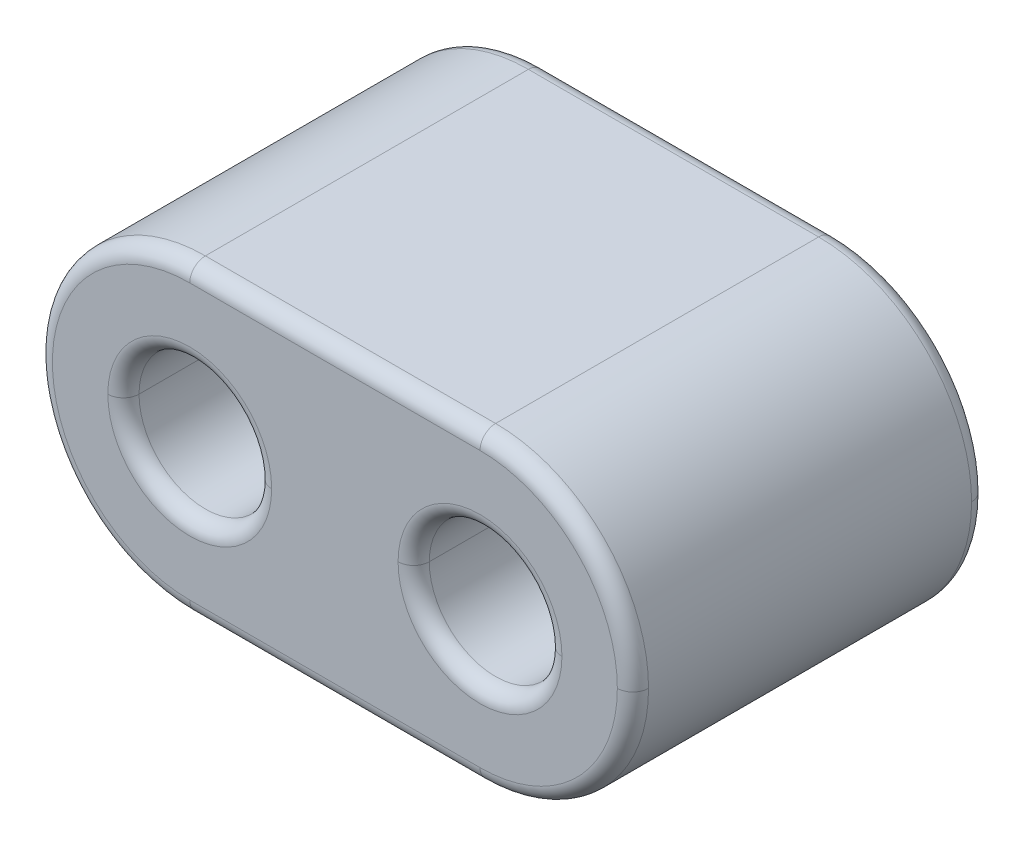
ISO-10303-21;
HEADER;
FILE_DESCRIPTION(('STEP AP214'),'2;1');
FILE_NAME('part.step','',(''),(''),'','','');
FILE_SCHEMA(('AUTOMOTIVE_DESIGN { 1 0 10303 214 1 1 1 1 }'));
ENDSEC;
DATA;
#1=APPLICATION_CONTEXT('core data for automotive mechanical design processes');
#2=APPLICATION_PROTOCOL_DEFINITION('international standard','automotive_design',2000,#1);
#3=PRODUCT_CONTEXT('',#1,'mechanical');
#4=PRODUCT('Part','Part','',(#3));
#5=PRODUCT_RELATED_PRODUCT_CATEGORY('part','',(#4));
#6=PRODUCT_DEFINITION_FORMATION('','',#4);
#7=PRODUCT_DEFINITION_CONTEXT('part definition',#1,'design');
#8=PRODUCT_DEFINITION('design','',#6,#7);
#9=PRODUCT_DEFINITION_SHAPE('','',#8);
#10=(LENGTH_UNIT() NAMED_UNIT(*) SI_UNIT(.MILLI.,.METRE.));
#11=(NAMED_UNIT(*) PLANE_ANGLE_UNIT() SI_UNIT($,.RADIAN.));
#12=(NAMED_UNIT(*) SI_UNIT($,.STERADIAN.) SOLID_ANGLE_UNIT());
#13=UNCERTAINTY_MEASURE_WITH_UNIT(LENGTH_MEASURE(1.E-05),#10,'distance_accuracy_value','');
#14=(GEOMETRIC_REPRESENTATION_CONTEXT(3) GLOBAL_UNCERTAINTY_ASSIGNED_CONTEXT((#13)) GLOBAL_UNIT_ASSIGNED_CONTEXT((#10,
#11,#12)) REPRESENTATION_CONTEXT('',''));
#15=CARTESIAN_POINT('',(0.,0.,0.));
#16=DIRECTION('',(0.,0.,1.));
#17=DIRECTION('',(1.,0.,0.));
#18=AXIS2_PLACEMENT_3D('',#15,#16,#17);
#19=CARTESIAN_POINT('',(-0.93,0.98,1.035));
#20=DIRECTION('',(0.,0.,1.));
#21=DIRECTION('',(1.,0.,0.));
#22=AXIS2_PLACEMENT_3D('',#19,#20,#21);
#23=TOROIDAL_SURFACE('',#22,0.525,0.1);
#24=CARTESIAN_POINT('',(-0.93,0.98,1.135));
#25=DIRECTION('',(0.,0.,-1.));
#26=DIRECTION('',(1.,0.,0.));
#27=AXIS2_PLACEMENT_3D('',#24,#25,#26);
#28=CIRCLE('',#27,0.525);
#29=CARTESIAN_POINT('',(-1.455,0.98,1.135));
#30=VERTEX_POINT('',#29);
#31=CARTESIAN_POINT('',(-0.405,0.98,1.135));
#32=VERTEX_POINT('',#31);
#33=EDGE_CURVE('E11',#30,#32,#28,.T.);
#34=ORIENTED_EDGE('',*,*,#33,.F.);
#35=CARTESIAN_POINT('',(-1.455,0.98,1.035));
#36=DIRECTION('',(0.,1.,0.));
#37=DIRECTION('',(-1.,0.,0.));
#38=AXIS2_PLACEMENT_3D('',#35,#36,#37);
#39=CIRCLE('',#38,0.1);
#40=CARTESIAN_POINT('',(-1.355,0.98,1.035));
#41=VERTEX_POINT('',#40);
#42=EDGE_CURVE('E24',#30,#41,#39,.T.);
#43=ORIENTED_EDGE('',*,*,#42,.T.);
#44=CARTESIAN_POINT('',(-0.93,0.98,1.035));
#45=DIRECTION('',(0.,0.,1.));
#46=DIRECTION('',(1.,0.,0.));
#47=AXIS2_PLACEMENT_3D('',#44,#45,#46);
#48=CIRCLE('',#47,0.425);
#49=CARTESIAN_POINT('',(-0.505,0.98,1.035));
#50=VERTEX_POINT('',#49);
#51=EDGE_CURVE('E314',#50,#41,#48,.T.);
#52=ORIENTED_EDGE('',*,*,#51,.F.);
#53=CARTESIAN_POINT('',(-0.405,0.98,1.035));
#54=DIRECTION('',(0.,-1.,0.));
#55=DIRECTION('',(0.,0.,-1.));
#56=AXIS2_PLACEMENT_3D('',#53,#54,#55);
#57=CIRCLE('',#56,0.1);
#58=EDGE_CURVE('E311',#32,#50,#57,.T.);
#59=ORIENTED_EDGE('',*,*,#58,.F.);
#60=EDGE_LOOP('',(#34,#43,#52,#59));
#61=FACE_BOUND('',#60,.T.);
#62=ADVANCED_FACE('F17',(#61),#23,.T.);
#63=CARTESIAN_POINT('',(-0.93,0.98,-1.035));
#64=DIRECTION('',(0.,0.,1.));
#65=DIRECTION('',(1.,0.,0.));
#66=AXIS2_PLACEMENT_3D('',#63,#64,#65);
#67=TOROIDAL_SURFACE('',#66,0.525,0.1);
#68=CARTESIAN_POINT('',(-0.93,0.98,-1.035));
#69=DIRECTION('',(0.,0.,-1.));
#70=DIRECTION('',(1.,0.,0.));
#71=AXIS2_PLACEMENT_3D('',#68,#69,#70);
#72=CIRCLE('',#71,0.425);
#73=CARTESIAN_POINT('',(-1.355,0.98,-1.035));
#74=VERTEX_POINT('',#73);
#75=CARTESIAN_POINT('',(-0.505,0.98,-1.035));
#76=VERTEX_POINT('',#75);
#77=EDGE_CURVE('E309',#74,#76,#72,.T.);
#78=ORIENTED_EDGE('',*,*,#77,.F.);
#79=CARTESIAN_POINT('',(-1.455,0.98,-1.035));
#80=DIRECTION('',(0.,1.,0.));
#81=DIRECTION('',(-1.,0.,0.));
#82=AXIS2_PLACEMENT_3D('',#79,#80,#81);
#83=CIRCLE('',#82,0.1);
#84=CARTESIAN_POINT('',(-1.455,0.98,-1.135));
#85=VERTEX_POINT('',#84);
#86=EDGE_CURVE('E307',#74,#85,#83,.T.);
#87=ORIENTED_EDGE('',*,*,#86,.T.);
#88=CARTESIAN_POINT('',(-0.93,0.98,-1.135));
#89=DIRECTION('',(0.,0.,1.));
#90=DIRECTION('',(1.,0.,0.));
#91=AXIS2_PLACEMENT_3D('',#88,#89,#90);
#92=CIRCLE('',#91,0.525);
#93=CARTESIAN_POINT('',(-0.405,0.98,-1.135));
#94=VERTEX_POINT('',#93);
#95=EDGE_CURVE('E304',#94,#85,#92,.T.);
#96=ORIENTED_EDGE('',*,*,#95,.F.);
#97=CARTESIAN_POINT('',(-0.405,0.98,-1.035));
#98=DIRECTION('',(0.,-1.,0.));
#99=DIRECTION('',(0.,0.,-1.));
#100=AXIS2_PLACEMENT_3D('',#97,#98,#99);
#101=CIRCLE('',#100,0.1);
#102=EDGE_CURVE('E301',#76,#94,#101,.T.);
#103=ORIENTED_EDGE('',*,*,#102,.F.);
#104=EDGE_LOOP('',(#78,#87,#96,#103));
#105=FACE_BOUND('',#104,.T.);
#106=ADVANCED_FACE('F345',(#105),#67,.T.);
#107=CARTESIAN_POINT('',(0.93,0.98,1.035));
#108=DIRECTION('',(0.,0.,1.));
#109=DIRECTION('',(1.,0.,0.));
#110=AXIS2_PLACEMENT_3D('',#107,#108,#109);
#111=TOROIDAL_SURFACE('',#110,0.525,0.1);
#112=CARTESIAN_POINT('',(0.93,0.98,1.135));
#113=DIRECTION('',(0.,0.,-1.));
#114=DIRECTION('',(1.,0.,0.));
#115=AXIS2_PLACEMENT_3D('',#112,#113,#114);
#116=CIRCLE('',#115,0.525);
#117=CARTESIAN_POINT('',(0.405,0.98,1.135));
#118=VERTEX_POINT('',#117);
#119=CARTESIAN_POINT('',(1.455,0.98,1.135));
#120=VERTEX_POINT('',#119);
#121=EDGE_CURVE('E299',#118,#120,#116,.T.);
#122=ORIENTED_EDGE('',*,*,#121,.F.);
#123=CARTESIAN_POINT('',(0.405,0.98,1.035));
#124=DIRECTION('',(0.,1.,0.));
#125=DIRECTION('',(-1.,0.,0.));
#126=AXIS2_PLACEMENT_3D('',#123,#124,#125);
#127=CIRCLE('',#126,0.1);
#128=CARTESIAN_POINT('',(0.505,0.98,1.035));
#129=VERTEX_POINT('',#128);
#130=EDGE_CURVE('E297',#118,#129,#127,.T.);
#131=ORIENTED_EDGE('',*,*,#130,.T.);
#132=CARTESIAN_POINT('',(0.93,0.98,1.035));
#133=DIRECTION('',(0.,0.,1.));
#134=DIRECTION('',(1.,0.,0.));
#135=AXIS2_PLACEMENT_3D('',#132,#133,#134);
#136=CIRCLE('',#135,0.425);
#137=CARTESIAN_POINT('',(1.355,0.98,1.035));
#138=VERTEX_POINT('',#137);
#139=EDGE_CURVE('E294',#138,#129,#136,.T.);
#140=ORIENTED_EDGE('',*,*,#139,.F.);
#141=CARTESIAN_POINT('',(1.455,0.98,1.035));
#142=DIRECTION('',(0.,-1.,0.));
#143=DIRECTION('',(0.,0.,-1.));
#144=AXIS2_PLACEMENT_3D('',#141,#142,#143);
#145=CIRCLE('',#144,0.1);
#146=EDGE_CURVE('E291',#120,#138,#145,.T.);
#147=ORIENTED_EDGE('',*,*,#146,.F.);
#148=EDGE_LOOP('',(#122,#131,#140,#147));
#149=FACE_BOUND('',#148,.T.);
#150=ADVANCED_FACE('F349',(#149),#111,.T.);
#151=CARTESIAN_POINT('',(0.93,0.98,-1.035));
#152=DIRECTION('',(0.,0.,1.));
#153=DIRECTION('',(1.,0.,0.));
#154=AXIS2_PLACEMENT_3D('',#151,#152,#153);
#155=TOROIDAL_SURFACE('',#154,0.525,0.1);
#156=CARTESIAN_POINT('',(0.93,0.98,-1.035));
#157=DIRECTION('',(0.,0.,-1.));
#158=DIRECTION('',(1.,0.,0.));
#159=AXIS2_PLACEMENT_3D('',#156,#157,#158);
#160=CIRCLE('',#159,0.425);
#161=CARTESIAN_POINT('',(0.505,0.98,-1.035));
#162=VERTEX_POINT('',#161);
#163=CARTESIAN_POINT('',(1.355,0.98,-1.035));
#164=VERTEX_POINT('',#163);
#165=EDGE_CURVE('E289',#162,#164,#160,.T.);
#166=ORIENTED_EDGE('',*,*,#165,.F.);
#167=CARTESIAN_POINT('',(0.405,0.98,-1.035));
#168=DIRECTION('',(0.,1.,0.));
#169=DIRECTION('',(-1.,0.,0.));
#170=AXIS2_PLACEMENT_3D('',#167,#168,#169);
#171=CIRCLE('',#170,0.1);
#172=CARTESIAN_POINT('',(0.405,0.98,-1.135));
#173=VERTEX_POINT('',#172);
#174=EDGE_CURVE('E287',#162,#173,#171,.T.);
#175=ORIENTED_EDGE('',*,*,#174,.T.);
#176=CARTESIAN_POINT('',(0.93,0.98,-1.135));
#177=DIRECTION('',(0.,0.,1.));
#178=DIRECTION('',(1.,0.,0.));
#179=AXIS2_PLACEMENT_3D('',#176,#177,#178);
#180=CIRCLE('',#179,0.525);
#181=CARTESIAN_POINT('',(1.455,0.98,-1.135));
#182=VERTEX_POINT('',#181);
#183=EDGE_CURVE('E284',#182,#173,#180,.T.);
#184=ORIENTED_EDGE('',*,*,#183,.F.);
#185=CARTESIAN_POINT('',(1.455,0.98,-1.035));
#186=DIRECTION('',(0.,-1.,0.));
#187=DIRECTION('',(0.,0.,-1.));
#188=AXIS2_PLACEMENT_3D('',#185,#186,#187);
#189=CIRCLE('',#188,0.1);
#190=EDGE_CURVE('E281',#164,#182,#189,.T.);
#191=ORIENTED_EDGE('',*,*,#190,.F.);
#192=EDGE_LOOP('',(#166,#175,#184,#191));
#193=FACE_BOUND('',#192,.T.);
#194=ADVANCED_FACE('F354',(#193),#155,.T.);
#195=CARTESIAN_POINT('',(0.93,0.98,1.035));
#196=DIRECTION('',(0.,0.,1.));
#197=DIRECTION('',(1.,0.,0.));
#198=AXIS2_PLACEMENT_3D('',#195,#196,#197);
#199=TOROIDAL_SURFACE('',#198,0.88,0.1);
#200=CARTESIAN_POINT('',(0.93,0.98,1.035));
#201=DIRECTION('',(0.,0.,-1.));
#202=DIRECTION('',(1.,0.,0.));
#203=AXIS2_PLACEMENT_3D('',#200,#201,#202);
#204=CIRCLE('',#203,0.98);
#205=CARTESIAN_POINT('',(1.91,0.98,1.035));
#206=VERTEX_POINT('',#205);
#207=CARTESIAN_POINT('',(0.93,0.,1.035));
#208=VERTEX_POINT('',#207);
#209=EDGE_CURVE('E279',#206,#208,#204,.T.);
#210=ORIENTED_EDGE('',*,*,#209,.F.);
#211=CARTESIAN_POINT('',(1.81,0.98,1.035));
#212=DIRECTION('',(0.,-1.,0.));
#213=DIRECTION('',(0.,0.,-1.));
#214=AXIS2_PLACEMENT_3D('',#211,#212,#213);
#215=CIRCLE('',#214,0.1);
#216=CARTESIAN_POINT('',(1.81,0.98,1.135));
#217=VERTEX_POINT('',#216);
#218=EDGE_CURVE('E277',#206,#217,#215,.T.);
#219=ORIENTED_EDGE('',*,*,#218,.T.);
#220=CARTESIAN_POINT('',(0.93,0.98,1.135));
#221=DIRECTION('',(0.,0.,1.));
#222=DIRECTION('',(1.,0.,0.));
#223=AXIS2_PLACEMENT_3D('',#220,#221,#222);
#224=CIRCLE('',#223,0.88);
#225=CARTESIAN_POINT('',(0.93,0.1,1.135));
#226=VERTEX_POINT('',#225);
#227=EDGE_CURVE('E274',#226,#217,#224,.T.);
#228=ORIENTED_EDGE('',*,*,#227,.F.);
#229=CARTESIAN_POINT('',(0.93,0.1,1.035));
#230=DIRECTION('',(1.,0.,0.));
#231=DIRECTION('',(0.,0.,-1.));
#232=AXIS2_PLACEMENT_3D('',#229,#230,#231);
#233=CIRCLE('',#232,0.1);
#234=EDGE_CURVE('E271',#226,#208,#233,.T.);
#235=ORIENTED_EDGE('',*,*,#234,.T.);
#236=EDGE_LOOP('',(#210,#219,#228,#235));
#237=FACE_BOUND('',#236,.T.);
#238=ADVANCED_FACE('F360',(#237),#199,.T.);
#239=CARTESIAN_POINT('',(0.93,0.98,-1.035));
#240=DIRECTION('',(0.,0.,1.));
#241=DIRECTION('',(1.,0.,0.));
#242=AXIS2_PLACEMENT_3D('',#239,#240,#241);
#243=TOROIDAL_SURFACE('',#242,0.88,0.1);
#244=CARTESIAN_POINT('',(0.93,0.98,-1.135));
#245=DIRECTION('',(0.,0.,-1.));
#246=DIRECTION('',(1.,0.,0.));
#247=AXIS2_PLACEMENT_3D('',#244,#245,#246);
#248=CIRCLE('',#247,0.88);
#249=CARTESIAN_POINT('',(1.81,0.98,-1.135));
#250=VERTEX_POINT('',#249);
#251=CARTESIAN_POINT('',(0.93,0.1,-1.135));
#252=VERTEX_POINT('',#251);
#253=EDGE_CURVE('E269',#250,#252,#248,.T.);
#254=ORIENTED_EDGE('',*,*,#253,.F.);
#255=CARTESIAN_POINT('',(1.81,0.98,-1.035));
#256=DIRECTION('',(0.,-1.,0.));
#257=DIRECTION('',(0.,0.,-1.));
#258=AXIS2_PLACEMENT_3D('',#255,#256,#257);
#259=CIRCLE('',#258,0.1);
#260=CARTESIAN_POINT('',(1.91,0.98,-1.035));
#261=VERTEX_POINT('',#260);
#262=EDGE_CURVE('E267',#250,#261,#259,.T.);
#263=ORIENTED_EDGE('',*,*,#262,.T.);
#264=CARTESIAN_POINT('',(0.93,0.98,-1.035));
#265=DIRECTION('',(0.,0.,1.));
#266=DIRECTION('',(1.,0.,0.));
#267=AXIS2_PLACEMENT_3D('',#264,#265,#266);
#268=CIRCLE('',#267,0.98);
#269=CARTESIAN_POINT('',(0.93,0.,-1.035));
#270=VERTEX_POINT('',#269);
#271=EDGE_CURVE('E264',#270,#261,#268,.T.);
#272=ORIENTED_EDGE('',*,*,#271,.F.);
#273=CARTESIAN_POINT('',(0.93,0.1,-1.035));
#274=DIRECTION('',(-1.,0.,0.));
#275=DIRECTION('',(0.,0.,1.));
#276=AXIS2_PLACEMENT_3D('',#273,#274,#275);
#277=CIRCLE('',#276,0.1);
#278=EDGE_CURVE('E261',#252,#270,#277,.T.);
#279=ORIENTED_EDGE('',*,*,#278,.F.);
#280=EDGE_LOOP('',(#254,#263,#272,#279));
#281=FACE_BOUND('',#280,.T.);
#282=ADVANCED_FACE('F364',(#281),#243,.T.);
#283=CARTESIAN_POINT('',(0.93,0.98,1.135));
#284=DIRECTION('',(0.,0.,-1.));
#285=DIRECTION('',(-1.,0.,0.));
#286=AXIS2_PLACEMENT_3D('',#283,#284,#285);
#287=CYLINDRICAL_SURFACE('',#286,0.425);
#288=CARTESIAN_POINT('',(0.93,0.98,1.035));
#289=DIRECTION('',(0.,0.,1.));
#290=DIRECTION('',(1.,0.,0.));
#291=AXIS2_PLACEMENT_3D('',#288,#289,#290);
#292=CIRCLE('',#291,0.425);
#293=EDGE_CURVE('E258',#129,#138,#292,.T.);
#294=ORIENTED_EDGE('',*,*,#293,.T.);
#295=DIRECTION('',(0.,0.,-1.));
#296=VECTOR('',#295,1.);
#297=CARTESIAN_POINT('',(1.355,0.98,1.135));
#298=LINE('',#297,#296);
#299=EDGE_CURVE('E255',#138,#164,#298,.T.);
#300=ORIENTED_EDGE('',*,*,#299,.T.);
#301=CARTESIAN_POINT('',(0.93,0.98,-1.035));
#302=DIRECTION('',(0.,0.,-1.));
#303=DIRECTION('',(1.,0.,0.));
#304=AXIS2_PLACEMENT_3D('',#301,#302,#303);
#305=CIRCLE('',#304,0.425);
#306=EDGE_CURVE('E252',#164,#162,#305,.T.);
#307=ORIENTED_EDGE('',*,*,#306,.T.);
#308=DIRECTION('',(0.,0.,-1.));
#309=VECTOR('',#308,1.);
#310=CARTESIAN_POINT('',(0.505,0.98,1.135));
#311=LINE('',#310,#309);
#312=EDGE_CURVE('E249',#129,#162,#311,.T.);
#313=ORIENTED_EDGE('',*,*,#312,.F.);
#314=EDGE_LOOP('',(#294,#300,#307,#313));
#315=FACE_BOUND('',#314,.T.);
#316=ADVANCED_FACE('F368',(#315),#287,.F.);
#317=CARTESIAN_POINT('',(-0.93,0.98,1.135));
#318=DIRECTION('',(0.,0.,-1.));
#319=DIRECTION('',(-1.,0.,0.));
#320=AXIS2_PLACEMENT_3D('',#317,#318,#319);
#321=CYLINDRICAL_SURFACE('',#320,0.425);
#322=CARTESIAN_POINT('',(-0.93,0.98,1.035));
#323=DIRECTION('',(0.,0.,1.));
#324=DIRECTION('',(1.,0.,0.));
#325=AXIS2_PLACEMENT_3D('',#322,#323,#324);
#326=CIRCLE('',#325,0.425);
#327=EDGE_CURVE('E246',#41,#50,#326,.T.);
#328=ORIENTED_EDGE('',*,*,#327,.T.);
#329=DIRECTION('',(0.,0.,-1.));
#330=VECTOR('',#329,1.);
#331=CARTESIAN_POINT('',(-0.505,0.98,1.135));
#332=LINE('',#331,#330);
#333=EDGE_CURVE('E243',#50,#76,#332,.T.);
#334=ORIENTED_EDGE('',*,*,#333,.T.);
#335=CARTESIAN_POINT('',(-0.93,0.98,-1.035));
#336=DIRECTION('',(0.,0.,-1.));
#337=DIRECTION('',(1.,0.,0.));
#338=AXIS2_PLACEMENT_3D('',#335,#336,#337);
#339=CIRCLE('',#338,0.425);
#340=EDGE_CURVE('E240',#76,#74,#339,.T.);
#341=ORIENTED_EDGE('',*,*,#340,.T.);
#342=DIRECTION('',(0.,0.,-1.));
#343=VECTOR('',#342,1.);
#344=CARTESIAN_POINT('',(-1.355,0.98,1.135));
#345=LINE('',#344,#343);
#346=EDGE_CURVE('E237',#41,#74,#345,.T.);
#347=ORIENTED_EDGE('',*,*,#346,.F.);
#348=EDGE_LOOP('',(#328,#334,#341,#347));
#349=FACE_BOUND('',#348,.T.);
#350=ADVANCED_FACE('F324',(#349),#321,.F.);
#351=CARTESIAN_POINT('',(-0.93,0.98,1.135));
#352=DIRECTION('',(0.,0.,-1.));
#353=DIRECTION('',(-1.,0.,0.));
#354=AXIS2_PLACEMENT_3D('',#351,#352,#353);
#355=CYLINDRICAL_SURFACE('',#354,0.98);
#356=CARTESIAN_POINT('',(-0.93,0.98,1.035));
#357=DIRECTION('',(0.,0.,-1.));
#358=DIRECTION('',(1.,0.,0.));
#359=AXIS2_PLACEMENT_3D('',#356,#357,#358);
#360=CIRCLE('',#359,0.98);
#361=CARTESIAN_POINT('',(-0.93,0.,1.035));
#362=VERTEX_POINT('',#361);
#363=CARTESIAN_POINT('',(-1.91,0.98,1.035));
#364=VERTEX_POINT('',#363);
#365=EDGE_CURVE('E235',#362,#364,#360,.T.);
#366=ORIENTED_EDGE('',*,*,#365,.T.);
#367=DIRECTION('',(0.,0.,-1.));
#368=VECTOR('',#367,1.);
#369=CARTESIAN_POINT('',(-1.91,0.98,1.135));
#370=LINE('',#369,#368);
#371=CARTESIAN_POINT('',(-1.91,0.98,-1.035));
#372=VERTEX_POINT('',#371);
#373=EDGE_CURVE('E233',#364,#372,#370,.T.);
#374=ORIENTED_EDGE('',*,*,#373,.T.);
#375=CARTESIAN_POINT('',(-0.93,0.98,-1.035));
#376=DIRECTION('',(0.,0.,1.));
#377=DIRECTION('',(1.,0.,0.));
#378=AXIS2_PLACEMENT_3D('',#375,#376,#377);
#379=CIRCLE('',#378,0.98);
#380=CARTESIAN_POINT('',(-0.93,0.,-1.035));
#381=VERTEX_POINT('',#380);
#382=EDGE_CURVE('E231',#372,#381,#379,.T.);
#383=ORIENTED_EDGE('',*,*,#382,.T.);
#384=DIRECTION('',(0.,0.,-1.));
#385=VECTOR('',#384,1.);
#386=CARTESIAN_POINT('',(-0.93,0.,1.135));
#387=LINE('',#386,#385);
#388=EDGE_CURVE('E228',#362,#381,#387,.T.);
#389=ORIENTED_EDGE('',*,*,#388,.F.);
#390=EDGE_LOOP('',(#366,#374,#383,#389));
#391=FACE_BOUND('',#390,.T.);
#392=ADVANCED_FACE('F330',(#391),#355,.T.);
#393=CARTESIAN_POINT('',(-0.93,0.98,1.135));
#394=DIRECTION('',(0.,0.,1.));
#395=DIRECTION('',(1.,0.,0.));
#396=AXIS2_PLACEMENT_3D('',#393,#394,#395);
#397=PLANE('',#396);
#398=ORIENTED_EDGE('',*,*,#227,.T.);
#399=CARTESIAN_POINT('',(0.93,0.98,1.135));
#400=DIRECTION('',(0.,0.,1.));
#401=DIRECTION('',(1.,0.,0.));
#402=AXIS2_PLACEMENT_3D('',#399,#400,#401);
#403=CIRCLE('',#402,0.88);
#404=CARTESIAN_POINT('',(0.93,1.86,1.135));
#405=VERTEX_POINT('',#404);
#406=EDGE_CURVE('E226',#217,#405,#403,.T.);
#407=ORIENTED_EDGE('',*,*,#406,.T.);
#408=DIRECTION('',(-1.,0.,0.));
#409=VECTOR('',#408,1.);
#410=CARTESIAN_POINT('',(-0.93,1.86,1.135));
#411=LINE('',#410,#409);
#412=CARTESIAN_POINT('',(-0.93,1.86,1.135));
#413=VERTEX_POINT('',#412);
#414=EDGE_CURVE('E224',#405,#413,#411,.T.);
#415=ORIENTED_EDGE('',*,*,#414,.T.);
#416=CARTESIAN_POINT('',(-0.93,0.98,1.135));
#417=DIRECTION('',(0.,0.,1.));
#418=DIRECTION('',(1.,0.,0.));
#419=AXIS2_PLACEMENT_3D('',#416,#417,#418);
#420=CIRCLE('',#419,0.88);
#421=CARTESIAN_POINT('',(-0.93,0.1,1.135));
#422=VERTEX_POINT('',#421);
#423=EDGE_CURVE('E222',#413,#422,#420,.T.);
#424=ORIENTED_EDGE('',*,*,#423,.T.);
#425=DIRECTION('',(1.,0.,0.));
#426=VECTOR('',#425,1.);
#427=CARTESIAN_POINT('',(0.93,0.1,1.135));
#428=LINE('',#427,#426);
#429=EDGE_CURVE('E219',#422,#226,#428,.T.);
#430=ORIENTED_EDGE('',*,*,#429,.T.);
#431=EDGE_LOOP('',(#398,#407,#415,#424,#430));
#432=FACE_BOUND('',#431,.T.);
#433=CARTESIAN_POINT('',(0.93,0.98,1.135));
#434=DIRECTION('',(0.,0.,-1.));
#435=DIRECTION('',(1.,0.,0.));
#436=AXIS2_PLACEMENT_3D('',#433,#434,#435);
#437=CIRCLE('',#436,0.525);
#438=EDGE_CURVE('E216',#120,#118,#437,.T.);
#439=ORIENTED_EDGE('',*,*,#438,.T.);
#440=ORIENTED_EDGE('',*,*,#121,.T.);
#441=EDGE_LOOP('',(#439,#440));
#442=FACE_BOUND('',#441,.T.);
#443=CARTESIAN_POINT('',(-0.93,0.98,1.135));
#444=DIRECTION('',(0.,0.,-1.));
#445=DIRECTION('',(1.,0.,0.));
#446=AXIS2_PLACEMENT_3D('',#443,#444,#445);
#447=CIRCLE('',#446,0.525);
#448=EDGE_CURVE('E214',#32,#30,#447,.T.);
#449=ORIENTED_EDGE('',*,*,#448,.T.);
#450=ORIENTED_EDGE('',*,*,#33,.T.);
#451=EDGE_LOOP('',(#449,#450));
#452=FACE_BOUND('',#451,.T.);
#453=ADVANCED_FACE('F327',(#432,#442,#452),#397,.T.);
#454=CARTESIAN_POINT('',(-0.93,0.98,1.135));
#455=DIRECTION('',(0.,0.,-1.));
#456=DIRECTION('',(-1.,0.,0.));
#457=AXIS2_PLACEMENT_3D('',#454,#455,#456);
#458=CYLINDRICAL_SURFACE('',#457,0.98);
#459=ORIENTED_EDGE('',*,*,#373,.F.);
#460=CARTESIAN_POINT('',(-0.93,0.98,1.035));
#461=DIRECTION('',(0.,0.,-1.));
#462=DIRECTION('',(1.,0.,0.));
#463=AXIS2_PLACEMENT_3D('',#460,#461,#462);
#464=CIRCLE('',#463,0.98);
#465=CARTESIAN_POINT('',(-0.93,1.96,1.035));
#466=VERTEX_POINT('',#465);
#467=EDGE_CURVE('E212',#364,#466,#464,.T.);
#468=ORIENTED_EDGE('',*,*,#467,.T.);
#469=DIRECTION('',(0.,0.,-1.));
#470=VECTOR('',#469,1.);
#471=CARTESIAN_POINT('',(-0.93,1.96,1.135));
#472=LINE('',#471,#470);
#473=CARTESIAN_POINT('',(-0.93,1.96,-1.035));
#474=VERTEX_POINT('',#473);
#475=EDGE_CURVE('E210',#466,#474,#472,.T.);
#476=ORIENTED_EDGE('',*,*,#475,.T.);
#477=CARTESIAN_POINT('',(-0.93,0.98,-1.035));
#478=DIRECTION('',(0.,0.,1.));
#479=DIRECTION('',(1.,0.,0.));
#480=AXIS2_PLACEMENT_3D('',#477,#478,#479);
#481=CIRCLE('',#480,0.98);
#482=EDGE_CURVE('E170',#474,#372,#481,.T.);
#483=ORIENTED_EDGE('',*,*,#482,.T.);
#484=EDGE_LOOP('',(#459,#468,#476,#483));
#485=FACE_BOUND('',#484,.T.);
#486=ADVANCED_FACE('F329',(#485),#458,.T.);
#487=CARTESIAN_POINT('',(-0.93,0.,1.135));
#488=DIRECTION('',(0.,1.,0.));
#489=DIRECTION('',(0.,0.,1.));
#490=AXIS2_PLACEMENT_3D('',#487,#488,#489);
#491=PLANE('',#490);
#492=ORIENTED_EDGE('',*,*,#388,.T.);
#493=DIRECTION('',(1.,0.,0.));
#494=VECTOR('',#493,1.);
#495=CARTESIAN_POINT('',(-0.93,0.,-1.035));
#496=LINE('',#495,#494);
#497=EDGE_CURVE('E206',#381,#270,#496,.T.);
#498=ORIENTED_EDGE('',*,*,#497,.T.);
#499=DIRECTION('',(0.,0.,-1.));
#500=VECTOR('',#499,1.);
#501=CARTESIAN_POINT('',(0.93,0.,1.135));
#502=LINE('',#501,#500);
#503=EDGE_CURVE('E203',#208,#270,#502,.T.);
#504=ORIENTED_EDGE('',*,*,#503,.F.);
#505=DIRECTION('',(-1.,0.,0.));
#506=VECTOR('',#505,1.);
#507=CARTESIAN_POINT('',(-0.93,0.,1.035));
#508=LINE('',#507,#506);
#509=EDGE_CURVE('E200',#208,#362,#508,.T.);
#510=ORIENTED_EDGE('',*,*,#509,.T.);
#511=EDGE_LOOP('',(#492,#498,#504,#510));
#512=FACE_BOUND('',#511,.T.);
#513=ADVANCED_FACE('F338',(#512),#491,.F.);
#514=CARTESIAN_POINT('',(0.93,0.98,1.135));
#515=DIRECTION('',(0.,0.,-1.));
#516=DIRECTION('',(-1.,0.,0.));
#517=AXIS2_PLACEMENT_3D('',#514,#515,#516);
#518=CYLINDRICAL_SURFACE('',#517,0.98);
#519=ORIENTED_EDGE('',*,*,#503,.T.);
#520=ORIENTED_EDGE('',*,*,#271,.T.);
#521=CARTESIAN_POINT('',(0.93,0.98,-1.035));
#522=DIRECTION('',(0.,0.,1.));
#523=DIRECTION('',(1.,0.,0.));
#524=AXIS2_PLACEMENT_3D('',#521,#522,#523);
#525=CIRCLE('',#524,0.98);
#526=CARTESIAN_POINT('',(0.93,1.96,-1.035));
#527=VERTEX_POINT('',#526);
#528=EDGE_CURVE('E198',#261,#527,#525,.T.);
#529=ORIENTED_EDGE('',*,*,#528,.T.);
#530=DIRECTION('',(0.,0.,-1.));
#531=VECTOR('',#530,1.);
#532=CARTESIAN_POINT('',(0.93,1.96,1.135));
#533=LINE('',#532,#531);
#534=CARTESIAN_POINT('',(0.93,1.96,1.035));
#535=VERTEX_POINT('',#534);
#536=EDGE_CURVE('E195',#535,#527,#533,.T.);
#537=ORIENTED_EDGE('',*,*,#536,.F.);
#538=CARTESIAN_POINT('',(0.93,0.98,1.035));
#539=DIRECTION('',(0.,0.,-1.));
#540=DIRECTION('',(1.,0.,0.));
#541=AXIS2_PLACEMENT_3D('',#538,#539,#540);
#542=CIRCLE('',#541,0.98);
#543=EDGE_CURVE('E192',#535,#206,#542,.T.);
#544=ORIENTED_EDGE('',*,*,#543,.T.);
#545=ORIENTED_EDGE('',*,*,#209,.T.);
#546=EDGE_LOOP('',(#519,#520,#529,#537,#544,#545));
#547=FACE_BOUND('',#546,.T.);
#548=ADVANCED_FACE('F409',(#547),#518,.T.);
#549=CARTESIAN_POINT('',(-0.93,1.96,1.135));
#550=DIRECTION('',(0.,-1.,0.));
#551=DIRECTION('',(0.,0.,-1.));
#552=AXIS2_PLACEMENT_3D('',#549,#550,#551);
#553=PLANE('',#552);
#554=ORIENTED_EDGE('',*,*,#536,.T.);
#555=DIRECTION('',(-1.,0.,0.));
#556=VECTOR('',#555,1.);
#557=CARTESIAN_POINT('',(-0.93,1.96,-1.035));
#558=LINE('',#557,#556);
#559=EDGE_CURVE('E190',#527,#474,#558,.T.);
#560=ORIENTED_EDGE('',*,*,#559,.T.);
#561=ORIENTED_EDGE('',*,*,#475,.F.);
#562=DIRECTION('',(1.,0.,0.));
#563=VECTOR('',#562,1.);
#564=CARTESIAN_POINT('',(0.93,1.96,1.035));
#565=LINE('',#564,#563);
#566=EDGE_CURVE('E187',#466,#535,#565,.T.);
#567=ORIENTED_EDGE('',*,*,#566,.T.);
#568=EDGE_LOOP('',(#554,#560,#561,#567));
#569=FACE_BOUND('',#568,.T.);
#570=ADVANCED_FACE('F419',(#569),#553,.F.);
#571=CARTESIAN_POINT('',(-0.93,0.98,1.135));
#572=DIRECTION('',(0.,0.,-1.));
#573=DIRECTION('',(-1.,0.,0.));
#574=AXIS2_PLACEMENT_3D('',#571,#572,#573);
#575=CYLINDRICAL_SURFACE('',#574,0.425);
#576=ORIENTED_EDGE('',*,*,#333,.F.);
#577=ORIENTED_EDGE('',*,*,#51,.T.);
#578=ORIENTED_EDGE('',*,*,#346,.T.);
#579=ORIENTED_EDGE('',*,*,#77,.T.);
#580=EDGE_LOOP('',(#576,#577,#578,#579));
#581=FACE_BOUND('',#580,.T.);
#582=ADVANCED_FACE('F322',(#581),#575,.F.);
#583=CARTESIAN_POINT('',(0.93,0.98,1.135));
#584=DIRECTION('',(0.,0.,-1.));
#585=DIRECTION('',(-1.,0.,0.));
#586=AXIS2_PLACEMENT_3D('',#583,#584,#585);
#587=CYLINDRICAL_SURFACE('',#586,0.425);
#588=ORIENTED_EDGE('',*,*,#299,.F.);
#589=ORIENTED_EDGE('',*,*,#139,.T.);
#590=ORIENTED_EDGE('',*,*,#312,.T.);
#591=ORIENTED_EDGE('',*,*,#165,.T.);
#592=EDGE_LOOP('',(#588,#589,#590,#591));
#593=FACE_BOUND('',#592,.T.);
#594=ADVANCED_FACE('F438',(#593),#587,.F.);
#595=CARTESIAN_POINT('',(-0.93,0.98,-1.135));
#596=DIRECTION('',(0.,0.,1.));
#597=DIRECTION('',(1.,0.,0.));
#598=AXIS2_PLACEMENT_3D('',#595,#596,#597);
#599=PLANE('',#598);
#600=CARTESIAN_POINT('',(0.93,0.98,-1.135));
#601=DIRECTION('',(0.,0.,-1.));
#602=DIRECTION('',(1.,0.,0.));
#603=AXIS2_PLACEMENT_3D('',#600,#601,#602);
#604=CIRCLE('',#603,0.88);
#605=CARTESIAN_POINT('',(0.93,1.86,-1.135));
#606=VERTEX_POINT('',#605);
#607=EDGE_CURVE('E185',#606,#250,#604,.T.);
#608=ORIENTED_EDGE('',*,*,#607,.T.);
#609=ORIENTED_EDGE('',*,*,#253,.T.);
#610=DIRECTION('',(-1.,0.,0.));
#611=VECTOR('',#610,1.);
#612=CARTESIAN_POINT('',(-0.93,0.1,-1.135));
#613=LINE('',#612,#611);
#614=CARTESIAN_POINT('',(-0.93,0.1,-1.135));
#615=VERTEX_POINT('',#614);
#616=EDGE_CURVE('E151',#252,#615,#613,.T.);
#617=ORIENTED_EDGE('',*,*,#616,.T.);
#618=CARTESIAN_POINT('',(-0.93,0.98,-1.135));
#619=DIRECTION('',(0.,0.,-1.));
#620=DIRECTION('',(1.,0.,0.));
#621=AXIS2_PLACEMENT_3D('',#618,#619,#620);
#622=CIRCLE('',#621,0.88);
#623=CARTESIAN_POINT('',(-0.93,1.86,-1.135));
#624=VERTEX_POINT('',#623);
#625=EDGE_CURVE('E143',#615,#624,#622,.T.);
#626=ORIENTED_EDGE('',*,*,#625,.T.);
#627=DIRECTION('',(1.,0.,0.));
#628=VECTOR('',#627,1.);
#629=CARTESIAN_POINT('',(-0.93,1.86,-1.135));
#630=LINE('',#629,#628);
#631=EDGE_CURVE('E148',#624,#606,#630,.T.);
#632=ORIENTED_EDGE('',*,*,#631,.T.);
#633=EDGE_LOOP('',(#608,#609,#617,#626,#632));
#634=FACE_BOUND('',#633,.T.);
#635=ORIENTED_EDGE('',*,*,#183,.T.);
#636=CARTESIAN_POINT('',(0.93,0.98,-1.135));
#637=DIRECTION('',(0.,0.,1.));
#638=DIRECTION('',(1.,0.,0.));
#639=AXIS2_PLACEMENT_3D('',#636,#637,#638);
#640=CIRCLE('',#639,0.525);
#641=EDGE_CURVE('E164',#173,#182,#640,.T.);
#642=ORIENTED_EDGE('',*,*,#641,.T.);
#643=EDGE_LOOP('',(#635,#642));
#644=FACE_BOUND('',#643,.T.);
#645=ORIENTED_EDGE('',*,*,#95,.T.);
#646=CARTESIAN_POINT('',(-0.93,0.98,-1.135));
#647=DIRECTION('',(0.,0.,1.));
#648=DIRECTION('',(1.,0.,0.));
#649=AXIS2_PLACEMENT_3D('',#646,#647,#648);
#650=CIRCLE('',#649,0.525);
#651=EDGE_CURVE('E174',#85,#94,#650,.T.);
#652=ORIENTED_EDGE('',*,*,#651,.T.);
#653=EDGE_LOOP('',(#645,#652));
#654=FACE_BOUND('',#653,.T.);
#655=ADVANCED_FACE('F146',(#634,#644,#654),#599,.F.);
#656=CARTESIAN_POINT('',(-0.93,1.86,-1.035));
#657=DIRECTION('',(-1.,0.,0.));
#658=DIRECTION('',(0.,0.,1.));
#659=AXIS2_PLACEMENT_3D('',#656,#657,#658);
#660=CYLINDRICAL_SURFACE('',#659,0.1);
#661=CARTESIAN_POINT('',(0.93,1.86,-1.035));
#662=DIRECTION('',(1.,0.,0.));
#663=DIRECTION('',(0.,0.,-1.));
#664=AXIS2_PLACEMENT_3D('',#661,#662,#663);
#665=CIRCLE('',#664,0.1);
#666=EDGE_CURVE('E163',#606,#527,#665,.T.);
#667=ORIENTED_EDGE('',*,*,#666,.F.);
#668=ORIENTED_EDGE('',*,*,#631,.F.);
#669=CARTESIAN_POINT('',(-0.93,1.86,-1.035));
#670=DIRECTION('',(-1.,0.,0.));
#671=DIRECTION('',(0.,0.,1.));
#672=AXIS2_PLACEMENT_3D('',#669,#670,#671);
#673=CIRCLE('',#672,0.1);
#674=EDGE_CURVE('E161',#474,#624,#673,.T.);
#675=ORIENTED_EDGE('',*,*,#674,.F.);
#676=ORIENTED_EDGE('',*,*,#559,.F.);
#677=EDGE_LOOP('',(#667,#668,#675,#676));
#678=FACE_BOUND('',#677,.T.);
#679=ADVANCED_FACE('F159',(#678),#660,.T.);
#680=CARTESIAN_POINT('',(-0.93,0.98,-1.035));
#681=DIRECTION('',(0.,0.,1.));
#682=DIRECTION('',(1.,0.,0.));
#683=AXIS2_PLACEMENT_3D('',#680,#681,#682);
#684=TOROIDAL_SURFACE('',#683,0.88,0.1);
#685=ORIENTED_EDGE('',*,*,#674,.T.);
#686=ORIENTED_EDGE('',*,*,#625,.F.);
#687=CARTESIAN_POINT('',(-0.93,0.1,-1.035));
#688=DIRECTION('',(1.,0.,0.));
#689=DIRECTION('',(0.,0.,-1.));
#690=AXIS2_PLACEMENT_3D('',#687,#688,#689);
#691=CIRCLE('',#690,0.1);
#692=EDGE_CURVE('E172',#381,#615,#691,.T.);
#693=ORIENTED_EDGE('',*,*,#692,.F.);
#694=ORIENTED_EDGE('',*,*,#382,.F.);
#695=ORIENTED_EDGE('',*,*,#482,.F.);
#696=EDGE_LOOP('',(#685,#686,#693,#694,#695));
#697=FACE_BOUND('',#696,.T.);
#698=ADVANCED_FACE('F167',(#697),#684,.T.);
#699=CARTESIAN_POINT('',(0.93,0.98,-1.035));
#700=DIRECTION('',(0.,0.,1.));
#701=DIRECTION('',(1.,0.,0.));
#702=AXIS2_PLACEMENT_3D('',#699,#700,#701);
#703=TOROIDAL_SURFACE('',#702,0.88,0.1);
#704=ORIENTED_EDGE('',*,*,#262,.F.);
#705=ORIENTED_EDGE('',*,*,#607,.F.);
#706=ORIENTED_EDGE('',*,*,#666,.T.);
#707=ORIENTED_EDGE('',*,*,#528,.F.);
#708=EDGE_LOOP('',(#704,#705,#706,#707));
#709=FACE_BOUND('',#708,.T.);
#710=ADVANCED_FACE('F472',(#709),#703,.T.);
#711=CARTESIAN_POINT('',(-0.93,0.1,-1.035));
#712=DIRECTION('',(1.,0.,0.));
#713=DIRECTION('',(0.,0.,-1.));
#714=AXIS2_PLACEMENT_3D('',#711,#712,#713);
#715=CYLINDRICAL_SURFACE('',#714,0.1);
#716=ORIENTED_EDGE('',*,*,#692,.T.);
#717=ORIENTED_EDGE('',*,*,#616,.F.);
#718=ORIENTED_EDGE('',*,*,#278,.T.);
#719=ORIENTED_EDGE('',*,*,#497,.F.);
#720=EDGE_LOOP('',(#716,#717,#718,#719));
#721=FACE_BOUND('',#720,.T.);
#722=ADVANCED_FACE('F481',(#721),#715,.T.);
#723=CARTESIAN_POINT('',(-0.93,0.1,1.035));
#724=DIRECTION('',(-1.,0.,0.));
#725=DIRECTION('',(0.,0.,1.));
#726=AXIS2_PLACEMENT_3D('',#723,#724,#725);
#727=CYLINDRICAL_SURFACE('',#726,0.1);
#728=CARTESIAN_POINT('',(-0.93,0.1,1.035));
#729=DIRECTION('',(-1.,0.,0.));
#730=DIRECTION('',(0.,0.,1.));
#731=AXIS2_PLACEMENT_3D('',#728,#729,#730);
#732=CIRCLE('',#731,0.1);
#733=EDGE_CURVE('E176',#362,#422,#732,.T.);
#734=ORIENTED_EDGE('',*,*,#733,.F.);
#735=ORIENTED_EDGE('',*,*,#509,.F.);
#736=ORIENTED_EDGE('',*,*,#234,.F.);
#737=ORIENTED_EDGE('',*,*,#429,.F.);
#738=EDGE_LOOP('',(#734,#735,#736,#737));
#739=FACE_BOUND('',#738,.T.);
#740=ADVANCED_FACE('F491',(#739),#727,.T.);
#741=CARTESIAN_POINT('',(0.93,0.98,1.035));
#742=DIRECTION('',(0.,0.,1.));
#743=DIRECTION('',(1.,0.,0.));
#744=AXIS2_PLACEMENT_3D('',#741,#742,#743);
#745=TOROIDAL_SURFACE('',#744,0.88,0.1);
#746=ORIENTED_EDGE('',*,*,#218,.F.);
#747=ORIENTED_EDGE('',*,*,#543,.F.);
#748=CARTESIAN_POINT('',(0.93,1.86,1.035));
#749=DIRECTION('',(-1.,0.,0.));
#750=DIRECTION('',(0.,0.,1.));
#751=AXIS2_PLACEMENT_3D('',#748,#749,#750);
#752=CIRCLE('',#751,0.1);
#753=EDGE_CURVE('E591',#405,#535,#752,.T.);
#754=ORIENTED_EDGE('',*,*,#753,.F.);
#755=ORIENTED_EDGE('',*,*,#406,.F.);
#756=EDGE_LOOP('',(#746,#747,#754,#755));
#757=FACE_BOUND('',#756,.T.);
#758=ADVANCED_FACE('F501',(#757),#745,.T.);
#759=CARTESIAN_POINT('',(-0.93,0.98,1.035));
#760=DIRECTION('',(0.,0.,1.));
#761=DIRECTION('',(1.,0.,0.));
#762=AXIS2_PLACEMENT_3D('',#759,#760,#761);
#763=TOROIDAL_SURFACE('',#762,0.88,0.1);
#764=ORIENTED_EDGE('',*,*,#733,.T.);
#765=ORIENTED_EDGE('',*,*,#423,.F.);
#766=CARTESIAN_POINT('',(-0.93,1.86,1.035));
#767=DIRECTION('',(1.,0.,0.));
#768=DIRECTION('',(0.,0.,-1.));
#769=AXIS2_PLACEMENT_3D('',#766,#767,#768);
#770=CIRCLE('',#769,0.1);
#771=EDGE_CURVE('E596',#466,#413,#770,.T.);
#772=ORIENTED_EDGE('',*,*,#771,.F.);
#773=ORIENTED_EDGE('',*,*,#467,.F.);
#774=ORIENTED_EDGE('',*,*,#365,.F.);
#775=EDGE_LOOP('',(#764,#765,#772,#773,#774));
#776=FACE_BOUND('',#775,.T.);
#777=ADVANCED_FACE('F511',(#776),#763,.T.);
#778=CARTESIAN_POINT('',(-0.93,1.86,1.035));
#779=DIRECTION('',(1.,0.,0.));
#780=DIRECTION('',(0.,0.,-1.));
#781=AXIS2_PLACEMENT_3D('',#778,#779,#780);
#782=CYLINDRICAL_SURFACE('',#781,0.1);
#783=ORIENTED_EDGE('',*,*,#753,.T.);
#784=ORIENTED_EDGE('',*,*,#566,.F.);
#785=ORIENTED_EDGE('',*,*,#771,.T.);
#786=ORIENTED_EDGE('',*,*,#414,.F.);
#787=EDGE_LOOP('',(#783,#784,#785,#786));
#788=FACE_BOUND('',#787,.T.);
#789=ADVANCED_FACE('F521',(#788),#782,.T.);
#790=CARTESIAN_POINT('',(0.93,0.98,-1.035));
#791=DIRECTION('',(0.,0.,1.));
#792=DIRECTION('',(1.,0.,0.));
#793=AXIS2_PLACEMENT_3D('',#790,#791,#792);
#794=TOROIDAL_SURFACE('',#793,0.525,0.1);
#795=ORIENTED_EDGE('',*,*,#174,.F.);
#796=ORIENTED_EDGE('',*,*,#306,.F.);
#797=ORIENTED_EDGE('',*,*,#190,.T.);
#798=ORIENTED_EDGE('',*,*,#641,.F.);
#799=EDGE_LOOP('',(#795,#796,#797,#798));
#800=FACE_BOUND('',#799,.T.);
#801=ADVANCED_FACE('F531',(#800),#794,.T.);
#802=CARTESIAN_POINT('',(0.93,0.98,1.035));
#803=DIRECTION('',(0.,0.,1.));
#804=DIRECTION('',(1.,0.,0.));
#805=AXIS2_PLACEMENT_3D('',#802,#803,#804);
#806=TOROIDAL_SURFACE('',#805,0.525,0.1);
#807=ORIENTED_EDGE('',*,*,#130,.F.);
#808=ORIENTED_EDGE('',*,*,#438,.F.);
#809=ORIENTED_EDGE('',*,*,#146,.T.);
#810=ORIENTED_EDGE('',*,*,#293,.F.);
#811=EDGE_LOOP('',(#807,#808,#809,#810));
#812=FACE_BOUND('',#811,.T.);
#813=ADVANCED_FACE('F541',(#812),#806,.T.);
#814=CARTESIAN_POINT('',(-0.93,0.98,-1.035));
#815=DIRECTION('',(0.,0.,1.));
#816=DIRECTION('',(1.,0.,0.));
#817=AXIS2_PLACEMENT_3D('',#814,#815,#816);
#818=TOROIDAL_SURFACE('',#817,0.525,0.1);
#819=ORIENTED_EDGE('',*,*,#86,.F.);
#820=ORIENTED_EDGE('',*,*,#340,.F.);
#821=ORIENTED_EDGE('',*,*,#102,.T.);
#822=ORIENTED_EDGE('',*,*,#651,.F.);
#823=EDGE_LOOP('',(#819,#820,#821,#822));
#824=FACE_BOUND('',#823,.T.);
#825=ADVANCED_FACE('F551',(#824),#818,.T.);
#826=CARTESIAN_POINT('',(-0.93,0.98,1.035));
#827=DIRECTION('',(0.,0.,1.));
#828=DIRECTION('',(1.,0.,0.));
#829=AXIS2_PLACEMENT_3D('',#826,#827,#828);
#830=TOROIDAL_SURFACE('',#829,0.525,0.1);
#831=ORIENTED_EDGE('',*,*,#42,.F.);
#832=ORIENTED_EDGE('',*,*,#448,.F.);
#833=ORIENTED_EDGE('',*,*,#58,.T.);
#834=ORIENTED_EDGE('',*,*,#327,.F.);
#835=EDGE_LOOP('',(#831,#832,#833,#834));
#836=FACE_BOUND('',#835,.T.);
#837=ADVANCED_FACE('F326',(#836),#830,.T.);
#838=CLOSED_SHELL('',(#62,#106,#150,#194,#238,#282,#316,#350,#392,#453,#486,#513,#548,#570,#582,
#594,#655,#679,#698,#710,#722,#740,#758,#777,#789,#801,#813,#825,#837));
#839=MANIFOLD_SOLID_BREP('B1',#838);
#840=ADVANCED_BREP_SHAPE_REPRESENTATION('',(#18,#839),#14);
#841=SHAPE_DEFINITION_REPRESENTATION(#9,#840);
ENDSEC;
END-ISO-10303-21;
